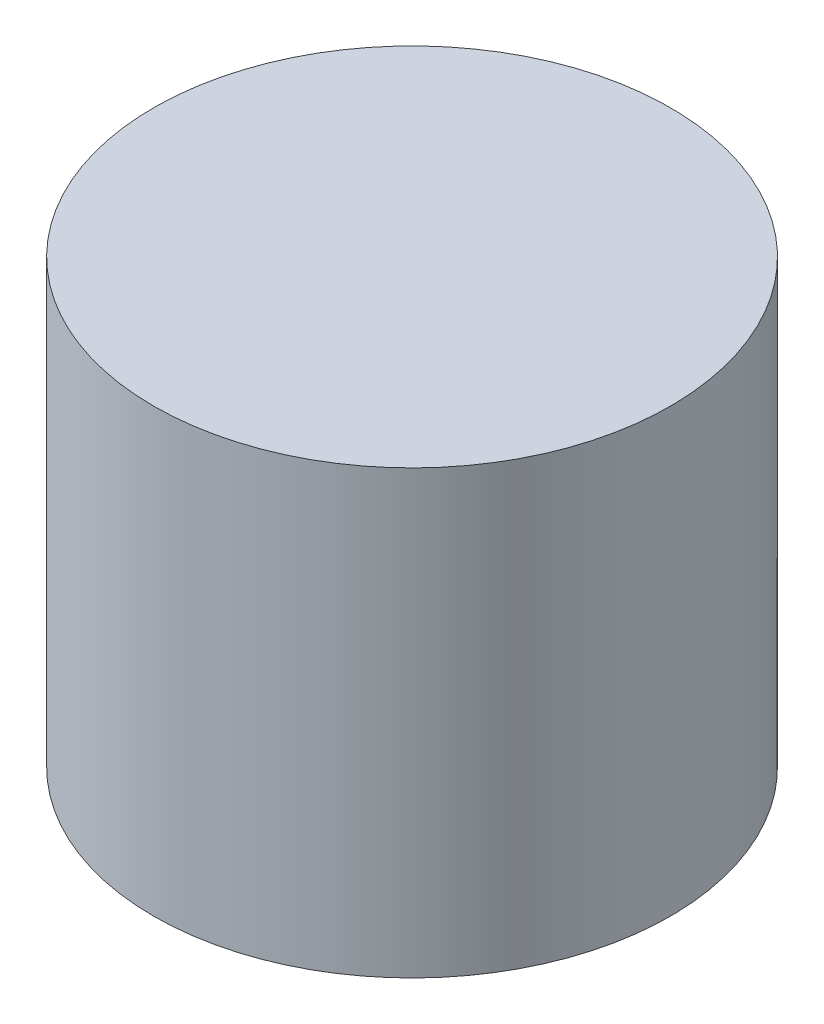
ISO-10303-21;
HEADER;
FILE_DESCRIPTION(('STEP AP214'),'2;1');
FILE_NAME('part.step','',(''),(''),'','','');
FILE_SCHEMA(('AUTOMOTIVE_DESIGN { 1 0 10303 214 1 1 1 1 }'));
ENDSEC;
DATA;
#1=APPLICATION_CONTEXT('core data for automotive mechanical design processes');
#2=APPLICATION_PROTOCOL_DEFINITION('international standard','automotive_design',2000,#1);
#3=PRODUCT_CONTEXT('',#1,'mechanical');
#4=PRODUCT('Part','Part','',(#3));
#5=PRODUCT_RELATED_PRODUCT_CATEGORY('part','',(#4));
#6=PRODUCT_DEFINITION_FORMATION('','',#4);
#7=PRODUCT_DEFINITION_CONTEXT('part definition',#1,'design');
#8=PRODUCT_DEFINITION('design','',#6,#7);
#9=PRODUCT_DEFINITION_SHAPE('','',#8);
#10=(LENGTH_UNIT() NAMED_UNIT(*) SI_UNIT(.MILLI.,.METRE.));
#11=(NAMED_UNIT(*) PLANE_ANGLE_UNIT() SI_UNIT($,.RADIAN.));
#12=(NAMED_UNIT(*) SI_UNIT($,.STERADIAN.) SOLID_ANGLE_UNIT());
#13=UNCERTAINTY_MEASURE_WITH_UNIT(LENGTH_MEASURE(1.E-05),#10,'distance_accuracy_value','');
#14=(GEOMETRIC_REPRESENTATION_CONTEXT(3) GLOBAL_UNCERTAINTY_ASSIGNED_CONTEXT((#13)) GLOBAL_UNIT_ASSIGNED_CONTEXT((#10,
#11,#12)) REPRESENTATION_CONTEXT('',''));
#15=CARTESIAN_POINT('',(0.,0.,0.));
#16=DIRECTION('',(0.,0.,1.));
#17=DIRECTION('',(1.,0.,0.));
#18=AXIS2_PLACEMENT_3D('',#15,#16,#17);
#19=CARTESIAN_POINT('',(35.6910008616356,10.,14.7928927351857));
#20=DIRECTION('',(0.,-1.,0.));
#21=DIRECTION('',(0.,0.,-1.));
#22=AXIS2_PLACEMENT_3D('',#19,#20,#21);
#23=CYLINDRICAL_SURFACE('',#22,5.85);
#24=CARTESIAN_POINT('',(35.6910008616356,10.,14.7928927351857));
#25=DIRECTION('',(0.,1.,0.));
#26=DIRECTION('',(0.,0.,1.));
#27=AXIS2_PLACEMENT_3D('',#24,#25,#26);
#28=CIRCLE('',#27,5.85);
#29=CARTESIAN_POINT('',(35.6910008616356,10.,20.6428927351857));
#30=VERTEX_POINT('',#29);
#31=EDGE_CURVE('E10',#30,#30,#28,.T.);
#32=ORIENTED_EDGE('',*,*,#31,.F.);
#33=EDGE_LOOP('',(#32));
#34=FACE_BOUND('',#33,.T.);
#35=CARTESIAN_POINT('',(35.6910008616356,0.,14.7928927351857));
#36=DIRECTION('',(0.,1.,0.));
#37=DIRECTION('',(0.,0.,1.));
#38=AXIS2_PLACEMENT_3D('',#35,#36,#37);
#39=CIRCLE('',#38,5.85);
#40=CARTESIAN_POINT('',(35.6910008616356,0.,20.6428927351857));
#41=VERTEX_POINT('',#40);
#42=EDGE_CURVE('E48',#41,#41,#39,.T.);
#43=ORIENTED_EDGE('',*,*,#42,.T.);
#44=EDGE_LOOP('',(#43));
#45=FACE_BOUND('',#44,.T.);
#46=ADVANCED_FACE('F45',(#34,#45),#23,.T.);
#47=CARTESIAN_POINT('',(35.6910008616356,10.,14.7928927351857));
#48=DIRECTION('',(0.,1.,0.));
#49=DIRECTION('',(0.,0.,1.));
#50=AXIS2_PLACEMENT_3D('',#47,#48,#49);
#51=PLANE('',#50);
#52=ORIENTED_EDGE('',*,*,#31,.T.);
#53=EDGE_LOOP('',(#52));
#54=FACE_BOUND('',#53,.T.);
#55=ADVANCED_FACE('F62',(#54),#51,.T.);
#56=CARTESIAN_POINT('',(35.6910008616356,0.,14.7928927351857));
#57=DIRECTION('',(0.,1.,0.));
#58=DIRECTION('',(0.,0.,1.));
#59=AXIS2_PLACEMENT_3D('',#56,#57,#58);
#60=PLANE('',#59);
#61=ORIENTED_EDGE('',*,*,#42,.F.);
#62=EDGE_LOOP('',(#61));
#63=FACE_BOUND('',#62,.T.);
#64=ADVANCED_FACE('F60',(#63),#60,.F.);
#65=CLOSED_SHELL('',(#46,#55,#64));
#66=MANIFOLD_SOLID_BREP('B2',#65);
#67=ADVANCED_BREP_SHAPE_REPRESENTATION('',(#18,#66),#14);
#68=SHAPE_DEFINITION_REPRESENTATION(#9,#67);
ENDSEC;
END-ISO-10303-21;
